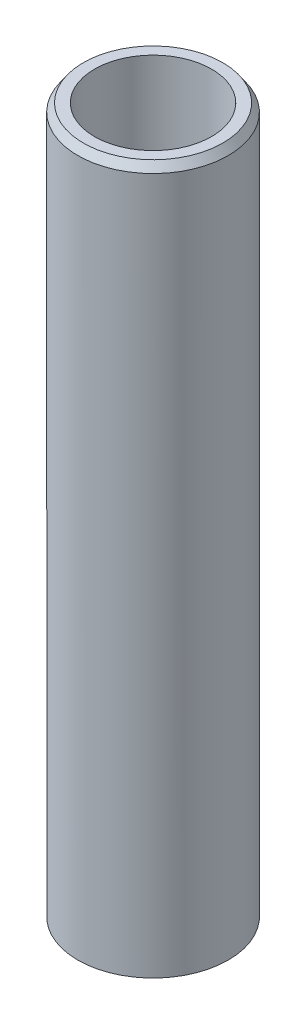
ISO-10303-21;
HEADER;
FILE_DESCRIPTION(('STEP AP214'),'2;1');
FILE_NAME('part.step','',(''),(''),'','','');
FILE_SCHEMA(('AUTOMOTIVE_DESIGN { 1 0 10303 214 1 1 1 1 }'));
ENDSEC;
DATA;
#1=APPLICATION_CONTEXT('core data for automotive mechanical design processes');
#2=APPLICATION_PROTOCOL_DEFINITION('international standard','automotive_design',2000,#1);
#3=PRODUCT_CONTEXT('',#1,'mechanical');
#4=PRODUCT('Part','Part','',(#3));
#5=PRODUCT_RELATED_PRODUCT_CATEGORY('part','',(#4));
#6=PRODUCT_DEFINITION_FORMATION('','',#4);
#7=PRODUCT_DEFINITION_CONTEXT('part definition',#1,'design');
#8=PRODUCT_DEFINITION('design','',#6,#7);
#9=PRODUCT_DEFINITION_SHAPE('','',#8);
#10=(LENGTH_UNIT() NAMED_UNIT(*) SI_UNIT(.MILLI.,.METRE.));
#11=(NAMED_UNIT(*) PLANE_ANGLE_UNIT() SI_UNIT($,.RADIAN.));
#12=(NAMED_UNIT(*) SI_UNIT($,.STERADIAN.) SOLID_ANGLE_UNIT());
#13=UNCERTAINTY_MEASURE_WITH_UNIT(LENGTH_MEASURE(1.E-05),#10,'distance_accuracy_value','');
#14=(GEOMETRIC_REPRESENTATION_CONTEXT(3) GLOBAL_UNCERTAINTY_ASSIGNED_CONTEXT((#13)) GLOBAL_UNIT_ASSIGNED_CONTEXT((#10,
#11,#12)) REPRESENTATION_CONTEXT('',''));
#15=CARTESIAN_POINT('',(0.,0.,0.));
#16=DIRECTION('',(0.,0.,1.));
#17=DIRECTION('',(1.,0.,0.));
#18=AXIS2_PLACEMENT_3D('',#15,#16,#17);
#19=CARTESIAN_POINT('',(0.,448.447720565998,0.));
#20=DIRECTION('',(0.,-1.,0.));
#21=DIRECTION('',(0.,0.,-1.));
#22=AXIS2_PLACEMENT_3D('',#19,#20,#21);
#23=CYLINDRICAL_SURFACE('',#22,47.5);
#24=CARTESIAN_POINT('',(0.,443.368867360661,0.));
#25=DIRECTION('',(0.,1.,0.));
#26=DIRECTION('',(0.,0.,1.));
#27=AXIS2_PLACEMENT_3D('',#24,#25,#26);
#28=CIRCLE('',#27,47.5);
#29=CARTESIAN_POINT('',(0.,443.368867360661,-47.5));
#30=VERTEX_POINT('',#29);
#31=EDGE_CURVE('E50',#30,#30,#28,.F.);
#32=ORIENTED_EDGE('',*,*,#31,.T.);
#33=EDGE_LOOP('',(#32));
#34=FACE_BOUND('',#33,.T.);
#35=CARTESIAN_POINT('',(0.,3.49032938767341,0.));
#36=DIRECTION('',(0.,1.,0.));
#37=DIRECTION('',(0.,0.,1.));
#38=AXIS2_PLACEMENT_3D('',#35,#36,#37);
#39=CIRCLE('',#38,47.5);
#40=CARTESIAN_POINT('',(0.,3.49032938767341,47.5));
#41=VERTEX_POINT('',#40);
#42=EDGE_CURVE('E51',#41,#41,#39,.T.);
#43=ORIENTED_EDGE('',*,*,#42,.T.);
#44=EDGE_LOOP('',(#43));
#45=FACE_BOUND('',#44,.T.);
#46=ADVANCED_FACE('F39',(#34,#45),#23,.T.);
#47=CARTESIAN_POINT('',(0.,448.447720565998,0.));
#48=DIRECTION('',(0.,1.,0.));
#49=DIRECTION('',(0.,0.,1.));
#50=AXIS2_PLACEMENT_3D('',#47,#48,#49);
#51=PLANE('',#50);
#52=CARTESIAN_POINT('',(0.,448.447720565998,0.));
#53=DIRECTION('',(0.,1.,0.));
#54=DIRECTION('',(0.,0.,1.));
#55=AXIS2_PLACEMENT_3D('',#52,#53,#54);
#56=CIRCLE('',#55,44.0096706123265);
#57=CARTESIAN_POINT('',(0.,448.447720565998,-44.0096706123265));
#58=VERTEX_POINT('',#57);
#59=EDGE_CURVE('E54',#58,#58,#56,.T.);
#60=ORIENTED_EDGE('',*,*,#59,.T.);
#61=EDGE_LOOP('',(#60));
#62=FACE_BOUND('',#61,.T.);
#63=CARTESIAN_POINT('',(0.,448.447720565998,0.));
#64=DIRECTION('',(0.,1.,0.));
#65=DIRECTION('',(0.,0.,1.));
#66=AXIS2_PLACEMENT_3D('',#63,#64,#65);
#67=CIRCLE('',#66,36.9462387385463);
#68=CARTESIAN_POINT('',(0.,448.447720565998,36.9462387385463));
#69=VERTEX_POINT('',#68);
#70=EDGE_CURVE('E58',#69,#69,#67,.T.);
#71=ORIENTED_EDGE('',*,*,#70,.F.);
#72=EDGE_LOOP('',(#71));
#73=FACE_BOUND('',#72,.T.);
#74=ADVANCED_FACE('F69',(#62,#73),#51,.T.);
#75=CARTESIAN_POINT('',(0.,0.,0.));
#76=DIRECTION('',(0.,1.,0.));
#77=DIRECTION('',(0.,0.,1.));
#78=AXIS2_PLACEMENT_3D('',#75,#76,#77);
#79=PLANE('',#78);
#80=CARTESIAN_POINT('',(0.,0.,0.));
#81=DIRECTION('',(0.,1.,0.));
#82=DIRECTION('',(0.,0.,1.));
#83=AXIS2_PLACEMENT_3D('',#80,#81,#82);
#84=CIRCLE('',#83,42.4211467946625);
#85=CARTESIAN_POINT('',(0.,0.,42.4211467946625));
#86=VERTEX_POINT('',#85);
#87=EDGE_CURVE('E10',#86,#86,#84,.F.);
#88=ORIENTED_EDGE('',*,*,#87,.T.);
#89=EDGE_LOOP('',(#88));
#90=FACE_BOUND('',#89,.T.);
#91=CARTESIAN_POINT('',(0.,0.,0.));
#92=DIRECTION('',(0.,1.,0.));
#93=DIRECTION('',(0.,0.,1.));
#94=AXIS2_PLACEMENT_3D('',#91,#92,#93);
#95=CIRCLE('',#94,36.9462387385463);
#96=CARTESIAN_POINT('',(0.,0.,36.9462387385463));
#97=VERTEX_POINT('',#96);
#98=EDGE_CURVE('E63',#97,#97,#95,.T.);
#99=ORIENTED_EDGE('',*,*,#98,.T.);
#100=EDGE_LOOP('',(#99));
#101=FACE_BOUND('',#100,.T.);
#102=ADVANCED_FACE('F75',(#90,#101),#79,.F.);
#103=CARTESIAN_POINT('',(0.,448.447720565998,0.));
#104=DIRECTION('',(0.,-1.,0.));
#105=DIRECTION('',(0.,0.,-1.));
#106=AXIS2_PLACEMENT_3D('',#103,#104,#105);
#107=CYLINDRICAL_SURFACE('',#106,36.9462387385463);
#108=ORIENTED_EDGE('',*,*,#70,.T.);
#109=EDGE_LOOP('',(#108));
#110=FACE_BOUND('',#109,.T.);
#111=ORIENTED_EDGE('',*,*,#98,.F.);
#112=EDGE_LOOP('',(#111));
#113=FACE_BOUND('',#112,.T.);
#114=ADVANCED_FACE('F70',(#110,#113),#107,.F.);
#115=CARTESIAN_POINT('',(0.,448.447720565998,0.));
#116=DIRECTION('',(0.,-1.,0.));
#117=DIRECTION('',(0.,0.,-1.));
#118=AXIS2_PLACEMENT_3D('',#115,#116,#117);
#119=CONICAL_SURFACE('',#118,44.0096706123265,0.602102523060771);
#120=CARTESIAN_POINT('',(0.,443.368867360661,-47.5));
#121=CARTESIAN_POINT('',(0.,443.421772081549,-47.4636424022118));
#122=CARTESIAN_POINT('',(0.,443.474676802438,-47.4272848044235));
#123=CARTESIAN_POINT('',(0.,443.580486244216,-47.354569608847));
#124=CARTESIAN_POINT('',(0.,443.633390965105,-47.3182120110587));
#125=CARTESIAN_POINT('',(0.,443.739200406883,-47.2454968154822));
#126=CARTESIAN_POINT('',(0.,443.792105127772,-47.2091392176939));
#127=CARTESIAN_POINT('',(0.,443.89791456955,-47.1364240221174));
#128=CARTESIAN_POINT('',(0.,443.950819290439,-47.1000664243291));
#129=CARTESIAN_POINT('',(0.,444.056628732217,-47.0273512287526));
#130=CARTESIAN_POINT('',(0.,444.109533453106,-46.9909936309643));
#131=CARTESIAN_POINT('',(0.,444.215342894884,-46.9182784353878));
#132=CARTESIAN_POINT('',(0.,444.268247615772,-46.8819208375995));
#133=CARTESIAN_POINT('',(0.,444.37405705755,-46.809205642023));
#134=CARTESIAN_POINT('',(0.,444.426961778439,-46.7728480442347));
#135=CARTESIAN_POINT('',(0.,444.532771220217,-46.7001328486582));
#136=CARTESIAN_POINT('',(0.,444.585675941106,-46.6637752508699));
#137=CARTESIAN_POINT('',(0.,444.691485382884,-46.5910600552934));
#138=CARTESIAN_POINT('',(0.,444.744390103773,-46.5547024575051));
#139=CARTESIAN_POINT('',(0.,444.850199545551,-46.4819872619286));
#140=CARTESIAN_POINT('',(0.,444.90310426644,-46.4456296641403));
#141=CARTESIAN_POINT('',(0.,445.008913708218,-46.3729144685638));
#142=CARTESIAN_POINT('',(0.,445.061818429106,-46.3365568707755));
#143=CARTESIAN_POINT('',(0.,445.167627870884,-46.263841675199));
#144=CARTESIAN_POINT('',(0.,445.220532591773,-46.2274840774107));
#145=CARTESIAN_POINT('',(0.,445.326342033551,-46.1547688818342));
#146=CARTESIAN_POINT('',(0.,445.37924675444,-46.1184112840459));
#147=CARTESIAN_POINT('',(0.,445.485056196218,-46.0456960884694));
#148=CARTESIAN_POINT('',(0.,445.537960917107,-46.0093384906811));
#149=CARTESIAN_POINT('',(0.,445.643770358885,-45.9366232951046));
#150=CARTESIAN_POINT('',(0.,445.696675079774,-45.9002656973163));
#151=CARTESIAN_POINT('',(0.,445.802484521552,-45.8275505017398));
#152=CARTESIAN_POINT('',(0.,445.85538924244,-45.7911929039516));
#153=CARTESIAN_POINT('',(0.,445.961198684218,-45.718477708375));
#154=CARTESIAN_POINT('',(0.,446.014103405107,-45.6821201105867));
#155=CARTESIAN_POINT('',(0.,446.119912846885,-45.6094049150102));
#156=CARTESIAN_POINT('',(0.,446.172817567774,-45.573047317222));
#157=CARTESIAN_POINT('',(0.,446.278627009552,-45.5003321216454));
#158=CARTESIAN_POINT('',(0.,446.331531730441,-45.4639745238572));
#159=CARTESIAN_POINT('',(0.,446.437341172219,-45.3912593282806));
#160=CARTESIAN_POINT('',(0.,446.490245893108,-45.3549017304924));
#161=CARTESIAN_POINT('',(0.,446.596055334885,-45.2821865349158));
#162=CARTESIAN_POINT('',(0.,446.648960055774,-45.2458289371276));
#163=CARTESIAN_POINT('',(0.,446.754769497552,-45.173113741551));
#164=CARTESIAN_POINT('',(0.,446.807674218441,-45.1367561437628));
#165=CARTESIAN_POINT('',(0.,446.913483660219,-45.0640409481862));
#166=CARTESIAN_POINT('',(0.,446.966388381108,-45.027683350398));
#167=CARTESIAN_POINT('',(0.,447.072197822886,-44.9549681548214));
#168=CARTESIAN_POINT('',(0.,447.125102543775,-44.9186105570332));
#169=CARTESIAN_POINT('',(0.,447.230911985553,-44.8458953614567));
#170=CARTESIAN_POINT('',(0.,447.283816706442,-44.8095377636684));
#171=CARTESIAN_POINT('',(0.,447.389626148219,-44.7368225680918));
#172=CARTESIAN_POINT('',(0.,447.442530869108,-44.7004649703036));
#173=CARTESIAN_POINT('',(0.,447.548340310886,-44.6277497747271));
#174=CARTESIAN_POINT('',(0.,447.601245031775,-44.5913921769388));
#175=CARTESIAN_POINT('',(0.,447.707054473553,-44.5186769813623));
#176=CARTESIAN_POINT('',(0.,447.759959194442,-44.482319383574));
#177=CARTESIAN_POINT('',(0.,447.86576863622,-44.4096041879975));
#178=CARTESIAN_POINT('',(0.,447.918673357109,-44.3732465902092));
#179=CARTESIAN_POINT('',(0.,448.024482798887,-44.3005313946327));
#180=CARTESIAN_POINT('',(0.,448.077387519776,-44.2641737968444));
#181=CARTESIAN_POINT('',(0.,448.183196961554,-44.1914586012679));
#182=CARTESIAN_POINT('',(0.,448.236101682442,-44.1551010034796));
#183=CARTESIAN_POINT('',(0.,448.34191112422,-44.0823858079031));
#184=CARTESIAN_POINT('',(0.,448.394815845109,-44.0460282101148));
#185=CARTESIAN_POINT('',(0.,448.447720565998,-44.0096706123265));
#186=B_SPLINE_CURVE_WITH_KNOTS('',3,(#120,#121,#122,#123,#124,#125,#126,#127,#128,#129,#130,
#131,#132,#133,#134,#135,#136,#137,#138,#139,#140,#141,#142,#143,#144,#145,#146,#147,#148,#149,
#150,#151,#152,#153,#154,#155,#156,#157,#158,#159,#160,#161,#162,#163,#164,#165,#166,#167,#168,
#169,#170,#171,#172,#173,#174,#175,#176,#177,#178,#179,#180,#181,#182,#183,#184,#185),
.UNSPECIFIED.,.F.,.F.,(4,2,2,2,2,2,2,2,2,2,2,2,2,2,2,2,2,2,2,2,2,2,2,2,2,2,2,2,2,2,2,2,4),(0.,
0.192580008524854,0.385160017049658,0.577740025574512,0.770320034099316,0.962900042624169,
1.15548005114898,1.34806005967383,1.54064006819864,1.73322007672348,1.92580008524829,
2.11838009377315,2.31096010229795,2.5035401108228,2.69612011934761,2.88870012787246,
3.08128013639727,3.27386014492207,3.46644015344693,3.65902016197173,3.85160017049659,
4.04418017902139,4.23676018754624,4.42934019607105,4.6219202045959,4.81450021312071,
5.00708022164556,5.19966023017037,5.39224023869522,5.58482024722003,5.77740025574488,
5.96998026426969,6.16256027279454),.UNSPECIFIED.);
#187=EDGE_CURVE('BSEAM81',#30,#58,#186,.T.);
#188=ORIENTED_EDGE('',*,*,#31,.F.);
#189=ORIENTED_EDGE('',*,*,#59,.F.);
#190=ORIENTED_EDGE('',*,*,#187,.T.);
#191=ORIENTED_EDGE('',*,*,#187,.F.);
#192=EDGE_LOOP('',(#188,#190,#189,#191));
#193=FACE_BOUND('',#192,.T.);
#194=ADVANCED_FACE('F81',(#193),#119,.T.);
#195=CARTESIAN_POINT('',(0.,3.49032938767341,0.));
#196=DIRECTION('',(0.,1.,0.));
#197=DIRECTION('',(0.,0.,1.));
#198=AXIS2_PLACEMENT_3D('',#195,#196,#197);
#199=CONICAL_SURFACE('',#198,47.5,0.968693803734133);
#200=ORIENTED_EDGE('',*,*,#87,.F.);
#201=EDGE_LOOP('',(#200));
#202=FACE_BOUND('',#201,.T.);
#203=ORIENTED_EDGE('',*,*,#42,.F.);
#204=EDGE_LOOP('',(#203));
#205=FACE_BOUND('',#204,.T.);
#206=ADVANCED_FACE('F45',(#202,#205),#199,.T.);
#207=CLOSED_SHELL('',(#46,#74,#102,#114,#194,#206));
#208=MANIFOLD_SOLID_BREP('B2',#207);
#209=ADVANCED_BREP_SHAPE_REPRESENTATION('',(#18,#208),#14);
#210=SHAPE_DEFINITION_REPRESENTATION(#9,#209);
ENDSEC;
END-ISO-10303-21;
